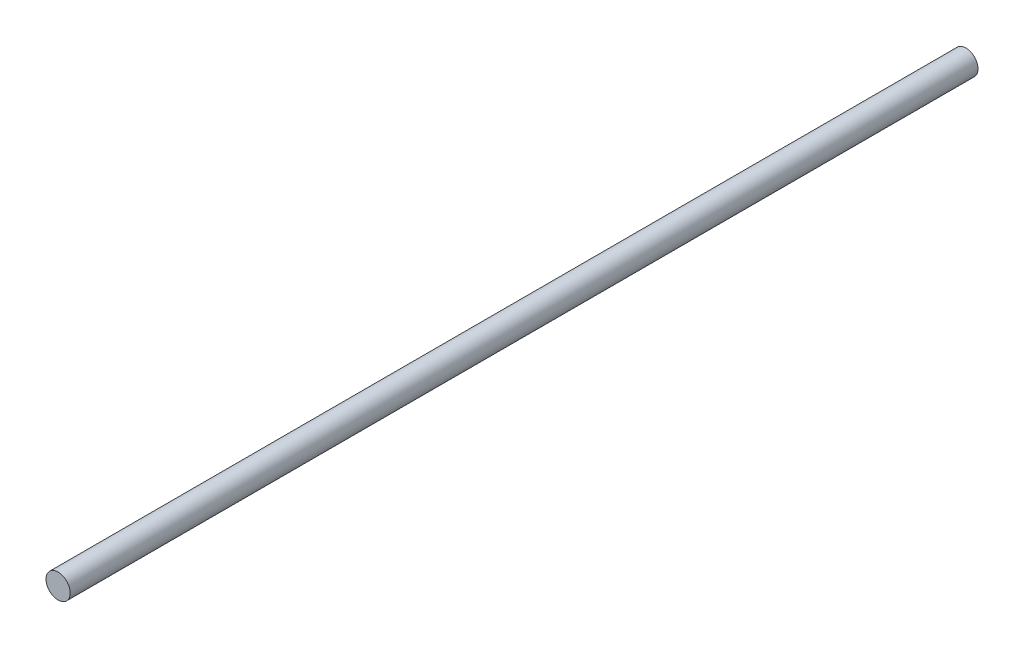
ISO-10303-21;
HEADER;
FILE_DESCRIPTION(('STEP AP214'),'2;1');
FILE_NAME('part.step','',(''),(''),'','','');
FILE_SCHEMA(('AUTOMOTIVE_DESIGN { 1 0 10303 214 1 1 1 1 }'));
ENDSEC;
DATA;
#1=APPLICATION_CONTEXT('core data for automotive mechanical design processes');
#2=APPLICATION_PROTOCOL_DEFINITION('international standard','automotive_design',2000,#1);
#3=PRODUCT_CONTEXT('',#1,'mechanical');
#4=PRODUCT('Part','Part','',(#3));
#5=PRODUCT_RELATED_PRODUCT_CATEGORY('part','',(#4));
#6=PRODUCT_DEFINITION_FORMATION('','',#4);
#7=PRODUCT_DEFINITION_CONTEXT('part definition',#1,'design');
#8=PRODUCT_DEFINITION('design','',#6,#7);
#9=PRODUCT_DEFINITION_SHAPE('','',#8);
#10=(LENGTH_UNIT() NAMED_UNIT(*) SI_UNIT(.MILLI.,.METRE.));
#11=(NAMED_UNIT(*) PLANE_ANGLE_UNIT() SI_UNIT($,.RADIAN.));
#12=(NAMED_UNIT(*) SI_UNIT($,.STERADIAN.) SOLID_ANGLE_UNIT());
#13=UNCERTAINTY_MEASURE_WITH_UNIT(LENGTH_MEASURE(1.E-05),#10,'distance_accuracy_value','');
#14=(GEOMETRIC_REPRESENTATION_CONTEXT(3) GLOBAL_UNCERTAINTY_ASSIGNED_CONTEXT((#13)) GLOBAL_UNIT_ASSIGNED_CONTEXT((#10,
#11,#12)) REPRESENTATION_CONTEXT('',''));
#15=CARTESIAN_POINT('',(0.,0.,0.));
#16=DIRECTION('',(0.,0.,1.));
#17=DIRECTION('',(1.,0.,0.));
#18=AXIS2_PLACEMENT_3D('',#15,#16,#17);
#19=CARTESIAN_POINT('',(0.,0.,75.));
#20=DIRECTION('',(0.,0.,-1.));
#21=DIRECTION('',(-1.,0.,0.));
#22=AXIS2_PLACEMENT_3D('',#19,#20,#21);
#23=CYLINDRICAL_SURFACE('',#22,2.);
#24=CARTESIAN_POINT('',(0.,0.,75.));
#25=DIRECTION('',(0.,0.,1.));
#26=DIRECTION('',(1.,0.,0.));
#27=AXIS2_PLACEMENT_3D('',#24,#25,#26);
#28=CIRCLE('',#27,2.);
#29=CARTESIAN_POINT('',(2.,0.,75.));
#30=VERTEX_POINT('',#29);
#31=EDGE_CURVE('E10',#30,#30,#28,.T.);
#32=ORIENTED_EDGE('',*,*,#31,.F.);
#33=EDGE_LOOP('',(#32));
#34=FACE_BOUND('',#33,.T.);
#35=CARTESIAN_POINT('',(0.,0.,-75.));
#36=DIRECTION('',(0.,0.,1.));
#37=DIRECTION('',(1.,0.,0.));
#38=AXIS2_PLACEMENT_3D('',#35,#36,#37);
#39=CIRCLE('',#38,2.);
#40=CARTESIAN_POINT('',(2.,0.,-75.));
#41=VERTEX_POINT('',#40);
#42=EDGE_CURVE('E42',#41,#41,#39,.T.);
#43=ORIENTED_EDGE('',*,*,#42,.T.);
#44=EDGE_LOOP('',(#43));
#45=FACE_BOUND('',#44,.T.);
#46=ADVANCED_FACE('F39',(#34,#45),#23,.T.);
#47=CARTESIAN_POINT('',(0.,0.,75.));
#48=DIRECTION('',(0.,0.,1.));
#49=DIRECTION('',(1.,0.,0.));
#50=AXIS2_PLACEMENT_3D('',#47,#48,#49);
#51=PLANE('',#50);
#52=ORIENTED_EDGE('',*,*,#31,.T.);
#53=EDGE_LOOP('',(#52));
#54=FACE_BOUND('',#53,.T.);
#55=ADVANCED_FACE('F54',(#54),#51,.T.);
#56=CARTESIAN_POINT('',(0.,0.,-75.));
#57=DIRECTION('',(0.,0.,1.));
#58=DIRECTION('',(1.,0.,0.));
#59=AXIS2_PLACEMENT_3D('',#56,#57,#58);
#60=PLANE('',#59);
#61=ORIENTED_EDGE('',*,*,#42,.F.);
#62=EDGE_LOOP('',(#61));
#63=FACE_BOUND('',#62,.T.);
#64=ADVANCED_FACE('F52',(#63),#60,.F.);
#65=CLOSED_SHELL('',(#46,#55,#64));
#66=MANIFOLD_SOLID_BREP('B2',#65);
#67=ADVANCED_BREP_SHAPE_REPRESENTATION('',(#18,#66),#14);
#68=SHAPE_DEFINITION_REPRESENTATION(#9,#67);
ENDSEC;
END-ISO-10303-21;
